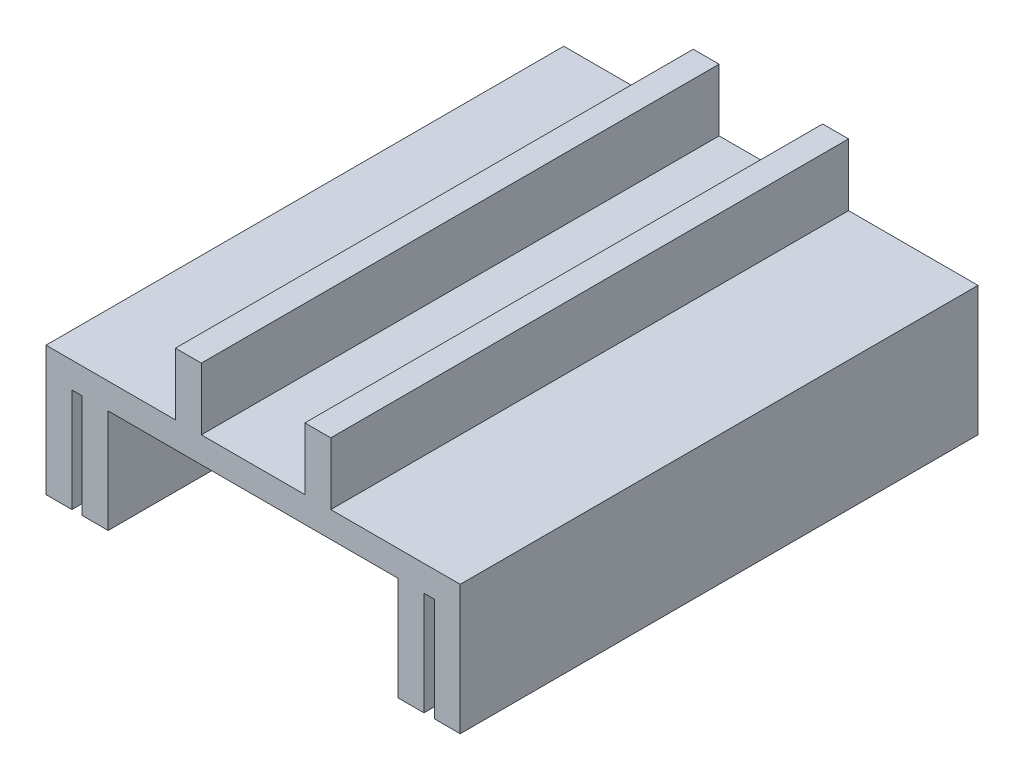
ISO-10303-21;
HEADER;
FILE_DESCRIPTION(('STEP AP214'),'2;1');
FILE_NAME('part.step','',(''),(''),'','','');
FILE_SCHEMA(('AUTOMOTIVE_DESIGN { 1 0 10303 214 1 1 1 1 }'));
ENDSEC;
DATA;
#1=APPLICATION_CONTEXT('core data for automotive mechanical design processes');
#2=APPLICATION_PROTOCOL_DEFINITION('international standard','automotive_design',2000,#1);
#3=PRODUCT_CONTEXT('',#1,'mechanical');
#4=PRODUCT('Part','Part','',(#3));
#5=PRODUCT_RELATED_PRODUCT_CATEGORY('part','',(#4));
#6=PRODUCT_DEFINITION_FORMATION('','',#4);
#7=PRODUCT_DEFINITION_CONTEXT('part definition',#1,'design');
#8=PRODUCT_DEFINITION('design','',#6,#7);
#9=PRODUCT_DEFINITION_SHAPE('','',#8);
#10=(LENGTH_UNIT() NAMED_UNIT(*) SI_UNIT(.MILLI.,.METRE.));
#11=(NAMED_UNIT(*) PLANE_ANGLE_UNIT() SI_UNIT($,.RADIAN.));
#12=(NAMED_UNIT(*) SI_UNIT($,.STERADIAN.) SOLID_ANGLE_UNIT());
#13=UNCERTAINTY_MEASURE_WITH_UNIT(LENGTH_MEASURE(1.E-05),#10,'distance_accuracy_value','');
#14=(GEOMETRIC_REPRESENTATION_CONTEXT(3) GLOBAL_UNCERTAINTY_ASSIGNED_CONTEXT((#13)) GLOBAL_UNIT_ASSIGNED_CONTEXT((#10,
#11,#12)) REPRESENTATION_CONTEXT('',''));
#15=CARTESIAN_POINT('',(0.,0.,0.));
#16=DIRECTION('',(0.,0.,1.));
#17=DIRECTION('',(1.,0.,0.));
#18=AXIS2_PLACEMENT_3D('',#15,#16,#17);
#19=CARTESIAN_POINT('',(0.,5.,0.));
#20=DIRECTION('',(0.,-1.,0.));
#21=DIRECTION('',(0.,0.,-1.));
#22=AXIS2_PLACEMENT_3D('',#19,#20,#21);
#23=PLANE('',#22);
#24=DIRECTION('',(0.,0.,1.));
#25=VECTOR('',#24,1.);
#26=CARTESIAN_POINT('',(9.99999999999999,5.,-50.));
#27=LINE('',#26,#25);
#28=CARTESIAN_POINT('',(9.99999999999999,5.,-50.));
#29=VERTEX_POINT('',#28);
#30=CARTESIAN_POINT('',(9.99999999999999,5.,50.));
#31=VERTEX_POINT('',#30);
#32=EDGE_CURVE('E48',#29,#31,#27,.T.);
#33=ORIENTED_EDGE('',*,*,#32,.F.);
#34=DIRECTION('',(-1.,0.,0.));
#35=VECTOR('',#34,1.);
#36=CARTESIAN_POINT('',(-40.,5.,-50.));
#37=LINE('',#36,#35);
#38=CARTESIAN_POINT('',(-10.,5.,-50.));
#39=VERTEX_POINT('',#38);
#40=EDGE_CURVE('E217',#29,#39,#37,.T.);
#41=ORIENTED_EDGE('',*,*,#40,.T.);
#42=DIRECTION('',(0.,0.,-1.));
#43=VECTOR('',#42,1.);
#44=CARTESIAN_POINT('',(-10.,5.,-50.));
#45=LINE('',#44,#43);
#46=CARTESIAN_POINT('',(-10.,5.,50.));
#47=VERTEX_POINT('',#46);
#48=EDGE_CURVE('E221',#47,#39,#45,.T.);
#49=ORIENTED_EDGE('',*,*,#48,.F.);
#50=DIRECTION('',(1.,0.,0.));
#51=VECTOR('',#50,1.);
#52=CARTESIAN_POINT('',(-40.,5.,50.));
#53=LINE('',#52,#51);
#54=EDGE_CURVE('E345',#47,#31,#53,.T.);
#55=ORIENTED_EDGE('',*,*,#54,.T.);
#56=EDGE_LOOP('',(#33,#41,#49,#55));
#57=FACE_BOUND('',#56,.T.);
#58=ADVANCED_FACE('F33',(#57),#23,.F.);
#59=DIRECTION('',(0.,0.,-1.));
#60=VECTOR('',#59,1.);
#61=CARTESIAN_POINT('',(15.,5.,50.));
#62=LINE('',#61,#60);
#63=CARTESIAN_POINT('',(15.,5.,50.));
#64=VERTEX_POINT('',#63);
#65=CARTESIAN_POINT('',(15.,5.,-50.));
#66=VERTEX_POINT('',#65);
#67=EDGE_CURVE('E213',#64,#66,#62,.T.);
#68=ORIENTED_EDGE('',*,*,#67,.F.);
#69=CARTESIAN_POINT('',(40.,5.,50.));
#70=VERTEX_POINT('',#69);
#71=EDGE_CURVE('E341',#64,#70,#53,.T.);
#72=ORIENTED_EDGE('',*,*,#71,.T.);
#73=DIRECTION('',(0.,0.,-1.));
#74=VECTOR('',#73,1.);
#75=CARTESIAN_POINT('',(40.,5.,50.));
#76=LINE('',#75,#74);
#77=CARTESIAN_POINT('',(40.,5.,-50.));
#78=VERTEX_POINT('',#77);
#79=EDGE_CURVE('E334',#70,#78,#76,.T.);
#80=ORIENTED_EDGE('',*,*,#79,.T.);
#81=EDGE_CURVE('E56',#78,#66,#37,.T.);
#82=ORIENTED_EDGE('',*,*,#81,.T.);
#83=EDGE_LOOP('',(#68,#72,#80,#82));
#84=FACE_BOUND('',#83,.T.);
#85=ADVANCED_FACE('F391',(#84),#23,.F.);
#86=DIRECTION('',(0.,0.,1.));
#87=VECTOR('',#86,1.);
#88=CARTESIAN_POINT('',(-15.,5.,50.));
#89=LINE('',#88,#87);
#90=CARTESIAN_POINT('',(-15.,5.,-50.));
#91=VERTEX_POINT('',#90);
#92=CARTESIAN_POINT('',(-15.,5.,50.));
#93=VERTEX_POINT('',#92);
#94=EDGE_CURVE('E218',#91,#93,#89,.T.);
#95=ORIENTED_EDGE('',*,*,#94,.F.);
#96=CARTESIAN_POINT('',(-40.,5.,-50.));
#97=VERTEX_POINT('',#96);
#98=EDGE_CURVE('E336',#91,#97,#37,.T.);
#99=ORIENTED_EDGE('',*,*,#98,.T.);
#100=DIRECTION('',(0.,0.,1.));
#101=VECTOR('',#100,1.);
#102=CARTESIAN_POINT('',(-40.,5.,50.));
#103=LINE('',#102,#101);
#104=CARTESIAN_POINT('',(-40.,5.,50.));
#105=VERTEX_POINT('',#104);
#106=EDGE_CURVE('E339',#97,#105,#103,.T.);
#107=ORIENTED_EDGE('',*,*,#106,.T.);
#108=EDGE_CURVE('E342',#105,#93,#53,.T.);
#109=ORIENTED_EDGE('',*,*,#108,.T.);
#110=EDGE_LOOP('',(#95,#99,#107,#109));
#111=FACE_BOUND('',#110,.T.);
#112=ADVANCED_FACE('F379',(#111),#23,.F.);
#113=CARTESIAN_POINT('',(0.,0.,0.));
#114=DIRECTION('',(0.,-1.,0.));
#115=DIRECTION('',(0.,0.,-1.));
#116=AXIS2_PLACEMENT_3D('',#113,#114,#115);
#117=PLANE('',#116);
#118=DIRECTION('',(-1.,0.,0.));
#119=VECTOR('',#118,1.);
#120=CARTESIAN_POINT('',(-40.,0.,-50.));
#121=LINE('',#120,#119);
#122=CARTESIAN_POINT('',(35.,0.,-50.));
#123=VERTEX_POINT('',#122);
#124=CARTESIAN_POINT('',(33.,0.,-50.));
#125=VERTEX_POINT('',#124);
#126=EDGE_CURVE('E346',#123,#125,#121,.T.);
#127=ORIENTED_EDGE('',*,*,#126,.F.);
#128=DIRECTION('',(0.,0.,-1.));
#129=VECTOR('',#128,1.);
#130=CARTESIAN_POINT('',(35.,0.,-50.));
#131=LINE('',#130,#129);
#132=CARTESIAN_POINT('',(35.,0.,50.));
#133=VERTEX_POINT('',#132);
#134=EDGE_CURVE('E249',#133,#123,#131,.T.);
#135=ORIENTED_EDGE('',*,*,#134,.F.);
#136=DIRECTION('',(1.,0.,0.));
#137=VECTOR('',#136,1.);
#138=CARTESIAN_POINT('',(-40.,0.,50.));
#139=LINE('',#138,#137);
#140=CARTESIAN_POINT('',(33.,0.,50.));
#141=VERTEX_POINT('',#140);
#142=EDGE_CURVE('E348',#141,#133,#139,.T.);
#143=ORIENTED_EDGE('',*,*,#142,.F.);
#144=DIRECTION('',(0.,0.,1.));
#145=VECTOR('',#144,1.);
#146=CARTESIAN_POINT('',(33.,0.,50.));
#147=LINE('',#146,#145);
#148=EDGE_CURVE('E271',#125,#141,#147,.T.);
#149=ORIENTED_EDGE('',*,*,#148,.F.);
#150=EDGE_LOOP('',(#127,#135,#143,#149));
#151=FACE_BOUND('',#150,.T.);
#152=ADVANCED_FACE('F412',(#151),#117,.T.);
#153=CARTESIAN_POINT('',(28.,0.,-50.));
#154=VERTEX_POINT('',#153);
#155=CARTESIAN_POINT('',(-28.,0.,-50.));
#156=VERTEX_POINT('',#155);
#157=EDGE_CURVE('E349',#154,#156,#121,.T.);
#158=ORIENTED_EDGE('',*,*,#157,.F.);
#159=DIRECTION('',(0.,0.,-1.));
#160=VECTOR('',#159,1.);
#161=CARTESIAN_POINT('',(28.,0.,-50.));
#162=LINE('',#161,#160);
#163=CARTESIAN_POINT('',(28.,0.,50.));
#164=VERTEX_POINT('',#163);
#165=EDGE_CURVE('E266',#164,#154,#162,.T.);
#166=ORIENTED_EDGE('',*,*,#165,.F.);
#167=CARTESIAN_POINT('',(-28.,0.,50.));
#168=VERTEX_POINT('',#167);
#169=EDGE_CURVE('E352',#168,#164,#139,.T.);
#170=ORIENTED_EDGE('',*,*,#169,.F.);
#171=DIRECTION('',(0.,0.,1.));
#172=VECTOR('',#171,1.);
#173=CARTESIAN_POINT('',(-28.,0.,-50.));
#174=LINE('',#173,#172);
#175=EDGE_CURVE('E295',#156,#168,#174,.T.);
#176=ORIENTED_EDGE('',*,*,#175,.F.);
#177=EDGE_LOOP('',(#158,#166,#170,#176));
#178=FACE_BOUND('',#177,.T.);
#179=ADVANCED_FACE('F433',(#178),#117,.T.);
#180=CARTESIAN_POINT('',(-33.,0.,-50.));
#181=VERTEX_POINT('',#180);
#182=CARTESIAN_POINT('',(-35.,0.,-50.));
#183=VERTEX_POINT('',#182);
#184=EDGE_CURVE('E333',#181,#183,#121,.T.);
#185=ORIENTED_EDGE('',*,*,#184,.F.);
#186=DIRECTION('',(0.,0.,-1.));
#187=VECTOR('',#186,1.);
#188=CARTESIAN_POINT('',(-33.,0.,50.));
#189=LINE('',#188,#187);
#190=CARTESIAN_POINT('',(-33.,0.,50.));
#191=VERTEX_POINT('',#190);
#192=EDGE_CURVE('E290',#191,#181,#189,.T.);
#193=ORIENTED_EDGE('',*,*,#192,.F.);
#194=CARTESIAN_POINT('',(-35.,0.,50.));
#195=VERTEX_POINT('',#194);
#196=EDGE_CURVE('E337',#195,#191,#139,.T.);
#197=ORIENTED_EDGE('',*,*,#196,.F.);
#198=DIRECTION('',(0.,0.,1.));
#199=VECTOR('',#198,1.);
#200=CARTESIAN_POINT('',(-35.,0.,-50.));
#201=LINE('',#200,#199);
#202=EDGE_CURVE('E314',#183,#195,#201,.T.);
#203=ORIENTED_EDGE('',*,*,#202,.F.);
#204=EDGE_LOOP('',(#185,#193,#197,#203));
#205=FACE_BOUND('',#204,.T.);
#206=ADVANCED_FACE('F448',(#205),#117,.T.);
#207=CARTESIAN_POINT('',(40.,5.,50.));
#208=DIRECTION('',(-1.,0.,0.));
#209=DIRECTION('',(0.,0.,1.));
#210=AXIS2_PLACEMENT_3D('',#207,#208,#209);
#211=PLANE('',#210);
#212=DIRECTION('',(0.,-1.,0.));
#213=VECTOR('',#212,1.);
#214=CARTESIAN_POINT('',(40.,5.,50.));
#215=LINE('',#214,#213);
#216=CARTESIAN_POINT('',(40.,-20.,50.));
#217=VERTEX_POINT('',#216);
#218=EDGE_CURVE('E344',#70,#217,#215,.T.);
#219=ORIENTED_EDGE('',*,*,#218,.T.);
#220=DIRECTION('',(0.,0.,1.));
#221=VECTOR('',#220,1.);
#222=CARTESIAN_POINT('',(40.,-20.,50.));
#223=LINE('',#222,#221);
#224=CARTESIAN_POINT('',(40.,-20.,-50.));
#225=VERTEX_POINT('',#224);
#226=EDGE_CURVE('E250',#225,#217,#223,.T.);
#227=ORIENTED_EDGE('',*,*,#226,.F.);
#228=DIRECTION('',(0.,-1.,0.));
#229=VECTOR('',#228,1.);
#230=CARTESIAN_POINT('',(40.,5.,-50.));
#231=LINE('',#230,#229);
#232=EDGE_CURVE('E11',#78,#225,#231,.T.);
#233=ORIENTED_EDGE('',*,*,#232,.F.);
#234=ORIENTED_EDGE('',*,*,#79,.F.);
#235=EDGE_LOOP('',(#219,#227,#233,#234));
#236=FACE_BOUND('',#235,.T.);
#237=ADVANCED_FACE('F35',(#236),#211,.F.);
#238=CARTESIAN_POINT('',(-40.,5.,-50.));
#239=DIRECTION('',(0.,0.,1.));
#240=DIRECTION('',(1.,0.,0.));
#241=AXIS2_PLACEMENT_3D('',#238,#239,#240);
#242=PLANE('',#241);
#243=ORIENTED_EDGE('',*,*,#232,.T.);
#244=DIRECTION('',(1.,0.,0.));
#245=VECTOR('',#244,1.);
#246=CARTESIAN_POINT('',(40.,-20.,-50.));
#247=LINE('',#246,#245);
#248=CARTESIAN_POINT('',(35.,-20.,-50.));
#249=VERTEX_POINT('',#248);
#250=EDGE_CURVE('E257',#249,#225,#247,.T.);
#251=ORIENTED_EDGE('',*,*,#250,.F.);
#252=DIRECTION('',(0.,1.,0.));
#253=VECTOR('',#252,1.);
#254=CARTESIAN_POINT('',(35.,-20.,-50.));
#255=LINE('',#254,#253);
#256=EDGE_CURVE('E260',#249,#123,#255,.T.);
#257=ORIENTED_EDGE('',*,*,#256,.T.);
#258=ORIENTED_EDGE('',*,*,#126,.T.);
#259=DIRECTION('',(0.,1.,0.));
#260=VECTOR('',#259,1.);
#261=CARTESIAN_POINT('',(33.,-20.,-50.));
#262=LINE('',#261,#260);
#263=CARTESIAN_POINT('',(33.,-20.,-50.));
#264=VERTEX_POINT('',#263);
#265=EDGE_CURVE('E285',#264,#125,#262,.T.);
#266=ORIENTED_EDGE('',*,*,#265,.F.);
#267=DIRECTION('',(1.,0.,0.));
#268=VECTOR('',#267,1.);
#269=CARTESIAN_POINT('',(33.,-20.,-50.));
#270=LINE('',#269,#268);
#271=CARTESIAN_POINT('',(28.,-20.,-50.));
#272=VERTEX_POINT('',#271);
#273=EDGE_CURVE('E270',#272,#264,#270,.T.);
#274=ORIENTED_EDGE('',*,*,#273,.F.);
#275=DIRECTION('',(0.,1.,0.));
#276=VECTOR('',#275,1.);
#277=CARTESIAN_POINT('',(28.,-20.,-50.));
#278=LINE('',#277,#276);
#279=EDGE_CURVE('E288',#272,#154,#278,.T.);
#280=ORIENTED_EDGE('',*,*,#279,.T.);
#281=ORIENTED_EDGE('',*,*,#157,.T.);
#282=DIRECTION('',(0.,1.,0.));
#283=VECTOR('',#282,1.);
#284=CARTESIAN_POINT('',(-28.,-20.,-50.));
#285=LINE('',#284,#283);
#286=CARTESIAN_POINT('',(-28.,-20.,-50.));
#287=VERTEX_POINT('',#286);
#288=EDGE_CURVE('E306',#287,#156,#285,.T.);
#289=ORIENTED_EDGE('',*,*,#288,.F.);
#290=DIRECTION('',(1.,0.,0.));
#291=VECTOR('',#290,1.);
#292=CARTESIAN_POINT('',(-33.,-20.,-50.));
#293=LINE('',#292,#291);
#294=CARTESIAN_POINT('',(-33.,-20.,-50.));
#295=VERTEX_POINT('',#294);
#296=EDGE_CURVE('E297',#295,#287,#293,.T.);
#297=ORIENTED_EDGE('',*,*,#296,.F.);
#298=DIRECTION('',(0.,1.,0.));
#299=VECTOR('',#298,1.);
#300=CARTESIAN_POINT('',(-33.,-20.,-50.));
#301=LINE('',#300,#299);
#302=EDGE_CURVE('E309',#295,#181,#301,.T.);
#303=ORIENTED_EDGE('',*,*,#302,.T.);
#304=ORIENTED_EDGE('',*,*,#184,.T.);
#305=DIRECTION('',(0.,1.,0.));
#306=VECTOR('',#305,1.);
#307=CARTESIAN_POINT('',(-35.,-20.,-50.));
#308=LINE('',#307,#306);
#309=CARTESIAN_POINT('',(-35.,-20.,-50.));
#310=VERTEX_POINT('',#309);
#311=EDGE_CURVE('E330',#310,#183,#308,.T.);
#312=ORIENTED_EDGE('',*,*,#311,.F.);
#313=DIRECTION('',(1.,0.,0.));
#314=VECTOR('',#313,1.);
#315=CARTESIAN_POINT('',(-40.,-20.,-50.));
#316=LINE('',#315,#314);
#317=CARTESIAN_POINT('',(-40.,-20.,-50.));
#318=VERTEX_POINT('',#317);
#319=EDGE_CURVE('E321',#318,#310,#316,.T.);
#320=ORIENTED_EDGE('',*,*,#319,.F.);
#321=DIRECTION('',(0.,-1.,0.));
#322=VECTOR('',#321,1.);
#323=CARTESIAN_POINT('',(-40.,5.,-50.));
#324=LINE('',#323,#322);
#325=EDGE_CURVE('E41',#97,#318,#324,.T.);
#326=ORIENTED_EDGE('',*,*,#325,.F.);
#327=ORIENTED_EDGE('',*,*,#98,.F.);
#328=DIRECTION('',(0.,-1.,0.));
#329=VECTOR('',#328,1.);
#330=CARTESIAN_POINT('',(-15.,17.,-50.));
#331=LINE('',#330,#329);
#332=CARTESIAN_POINT('',(-15.,17.,-50.));
#333=VERTEX_POINT('',#332);
#334=EDGE_CURVE('E246',#333,#91,#331,.T.);
#335=ORIENTED_EDGE('',*,*,#334,.F.);
#336=DIRECTION('',(-1.,0.,0.));
#337=VECTOR('',#336,1.);
#338=CARTESIAN_POINT('',(-15.,17.,-50.));
#339=LINE('',#338,#337);
#340=CARTESIAN_POINT('',(-10.,17.,-50.));
#341=VERTEX_POINT('',#340);
#342=EDGE_CURVE('E227',#341,#333,#339,.T.);
#343=ORIENTED_EDGE('',*,*,#342,.F.);
#344=DIRECTION('',(0.,-1.,0.));
#345=VECTOR('',#344,1.);
#346=CARTESIAN_POINT('',(-10.,17.,-50.));
#347=LINE('',#346,#345);
#348=EDGE_CURVE('E235',#341,#39,#347,.T.);
#349=ORIENTED_EDGE('',*,*,#348,.T.);
#350=ORIENTED_EDGE('',*,*,#40,.F.);
#351=DIRECTION('',(0.,-1.,0.));
#352=VECTOR('',#351,1.);
#353=CARTESIAN_POINT('',(9.99999999999999,17.,-50.));
#354=LINE('',#353,#352);
#355=CARTESIAN_POINT('',(9.99999999999999,17.,-50.));
#356=VERTEX_POINT('',#355);
#357=EDGE_CURVE('E198',#356,#29,#354,.T.);
#358=ORIENTED_EDGE('',*,*,#357,.F.);
#359=DIRECTION('',(-1.,0.,0.));
#360=VECTOR('',#359,1.);
#361=CARTESIAN_POINT('',(15.,17.,-50.));
#362=LINE('',#361,#360);
#363=CARTESIAN_POINT('',(15.,17.,-50.));
#364=VERTEX_POINT('',#363);
#365=EDGE_CURVE('E204',#364,#356,#362,.T.);
#366=ORIENTED_EDGE('',*,*,#365,.F.);
#367=DIRECTION('',(0.,-1.,0.));
#368=VECTOR('',#367,1.);
#369=CARTESIAN_POINT('',(15.,17.,-50.));
#370=LINE('',#369,#368);
#371=EDGE_CURVE('E633',#364,#66,#370,.T.);
#372=ORIENTED_EDGE('',*,*,#371,.T.);
#373=ORIENTED_EDGE('',*,*,#81,.F.);
#374=EDGE_LOOP('',(#243,#251,#257,#258,#266,#274,#280,#281,#289,#297,#303,#304,#312,#320,#326,
#327,#335,#343,#349,#350,#358,#366,#372,#373));
#375=FACE_BOUND('',#374,.T.);
#376=ADVANCED_FACE('F215',(#375),#242,.F.);
#377=CARTESIAN_POINT('',(-40.,5.,50.));
#378=DIRECTION('',(1.,0.,0.));
#379=DIRECTION('',(0.,0.,-1.));
#380=AXIS2_PLACEMENT_3D('',#377,#378,#379);
#381=PLANE('',#380);
#382=ORIENTED_EDGE('',*,*,#325,.T.);
#383=DIRECTION('',(0.,0.,-1.));
#384=VECTOR('',#383,1.);
#385=CARTESIAN_POINT('',(-40.,-20.,50.));
#386=LINE('',#385,#384);
#387=CARTESIAN_POINT('',(-40.,-20.,50.));
#388=VERTEX_POINT('',#387);
#389=EDGE_CURVE('E318',#388,#318,#386,.T.);
#390=ORIENTED_EDGE('',*,*,#389,.F.);
#391=DIRECTION('',(0.,-1.,0.));
#392=VECTOR('',#391,1.);
#393=CARTESIAN_POINT('',(-40.,5.,50.));
#394=LINE('',#393,#392);
#395=EDGE_CURVE('E354',#105,#388,#394,.T.);
#396=ORIENTED_EDGE('',*,*,#395,.F.);
#397=ORIENTED_EDGE('',*,*,#106,.F.);
#398=EDGE_LOOP('',(#382,#390,#396,#397));
#399=FACE_BOUND('',#398,.T.);
#400=ADVANCED_FACE('F359',(#399),#381,.F.);
#401=CARTESIAN_POINT('',(-40.,5.,50.));
#402=DIRECTION('',(0.,0.,-1.));
#403=DIRECTION('',(-1.,0.,0.));
#404=AXIS2_PLACEMENT_3D('',#401,#402,#403);
#405=PLANE('',#404);
#406=ORIENTED_EDGE('',*,*,#395,.T.);
#407=DIRECTION('',(-1.,0.,0.));
#408=VECTOR('',#407,1.);
#409=CARTESIAN_POINT('',(-35.,-20.,50.));
#410=LINE('',#409,#408);
#411=CARTESIAN_POINT('',(-35.,-20.,50.));
#412=VERTEX_POINT('',#411);
#413=EDGE_CURVE('E315',#412,#388,#410,.T.);
#414=ORIENTED_EDGE('',*,*,#413,.F.);
#415=DIRECTION('',(0.,1.,0.));
#416=VECTOR('',#415,1.);
#417=CARTESIAN_POINT('',(-35.,-20.,50.));
#418=LINE('',#417,#416);
#419=EDGE_CURVE('E325',#412,#195,#418,.T.);
#420=ORIENTED_EDGE('',*,*,#419,.T.);
#421=ORIENTED_EDGE('',*,*,#196,.T.);
#422=DIRECTION('',(0.,1.,0.));
#423=VECTOR('',#422,1.);
#424=CARTESIAN_POINT('',(-33.,-20.,50.));
#425=LINE('',#424,#423);
#426=CARTESIAN_POINT('',(-33.,-20.,50.));
#427=VERTEX_POINT('',#426);
#428=EDGE_CURVE('E312',#427,#191,#425,.T.);
#429=ORIENTED_EDGE('',*,*,#428,.F.);
#430=DIRECTION('',(-1.,0.,0.));
#431=VECTOR('',#430,1.);
#432=CARTESIAN_POINT('',(-28.,-20.,50.));
#433=LINE('',#432,#431);
#434=CARTESIAN_POINT('',(-28.,-20.,50.));
#435=VERTEX_POINT('',#434);
#436=EDGE_CURVE('E291',#435,#427,#433,.T.);
#437=ORIENTED_EDGE('',*,*,#436,.F.);
#438=DIRECTION('',(0.,1.,0.));
#439=VECTOR('',#438,1.);
#440=CARTESIAN_POINT('',(-28.,-20.,50.));
#441=LINE('',#440,#439);
#442=EDGE_CURVE('E301',#435,#168,#441,.T.);
#443=ORIENTED_EDGE('',*,*,#442,.T.);
#444=ORIENTED_EDGE('',*,*,#169,.T.);
#445=DIRECTION('',(0.,1.,0.));
#446=VECTOR('',#445,1.);
#447=CARTESIAN_POINT('',(28.,-20.,50.));
#448=LINE('',#447,#446);
#449=CARTESIAN_POINT('',(28.,-20.,50.));
#450=VERTEX_POINT('',#449);
#451=EDGE_CURVE('E277',#450,#164,#448,.T.);
#452=ORIENTED_EDGE('',*,*,#451,.F.);
#453=DIRECTION('',(-1.,0.,0.));
#454=VECTOR('',#453,1.);
#455=CARTESIAN_POINT('',(28.,-20.,50.));
#456=LINE('',#455,#454);
#457=CARTESIAN_POINT('',(33.,-20.,50.));
#458=VERTEX_POINT('',#457);
#459=EDGE_CURVE('E275',#458,#450,#456,.T.);
#460=ORIENTED_EDGE('',*,*,#459,.F.);
#461=DIRECTION('',(0.,1.,0.));
#462=VECTOR('',#461,1.);
#463=CARTESIAN_POINT('',(33.,-20.,50.));
#464=LINE('',#463,#462);
#465=EDGE_CURVE('E283',#458,#141,#464,.T.);
#466=ORIENTED_EDGE('',*,*,#465,.T.);
#467=ORIENTED_EDGE('',*,*,#142,.T.);
#468=DIRECTION('',(0.,1.,0.));
#469=VECTOR('',#468,1.);
#470=CARTESIAN_POINT('',(35.,-20.,50.));
#471=LINE('',#470,#469);
#472=CARTESIAN_POINT('',(35.,-20.,50.));
#473=VERTEX_POINT('',#472);
#474=EDGE_CURVE('E264',#473,#133,#471,.T.);
#475=ORIENTED_EDGE('',*,*,#474,.F.);
#476=DIRECTION('',(-1.,0.,0.));
#477=VECTOR('',#476,1.);
#478=CARTESIAN_POINT('',(35.,-20.,50.));
#479=LINE('',#478,#477);
#480=EDGE_CURVE('E253',#217,#473,#479,.T.);
#481=ORIENTED_EDGE('',*,*,#480,.F.);
#482=ORIENTED_EDGE('',*,*,#218,.F.);
#483=ORIENTED_EDGE('',*,*,#71,.F.);
#484=DIRECTION('',(0.,-1.,0.));
#485=VECTOR('',#484,1.);
#486=CARTESIAN_POINT('',(15.,17.,50.));
#487=LINE('',#486,#485);
#488=CARTESIAN_POINT('',(15.,17.,50.));
#489=VERTEX_POINT('',#488);
#490=EDGE_CURVE('E223',#489,#64,#487,.T.);
#491=ORIENTED_EDGE('',*,*,#490,.F.);
#492=DIRECTION('',(1.,0.,0.));
#493=VECTOR('',#492,1.);
#494=CARTESIAN_POINT('',(10.,17.,50.));
#495=LINE('',#494,#493);
#496=CARTESIAN_POINT('',(10.,17.,50.));
#497=VERTEX_POINT('',#496);
#498=EDGE_CURVE('E203',#497,#489,#495,.T.);
#499=ORIENTED_EDGE('',*,*,#498,.F.);
#500=DIRECTION('',(0.,-1.,0.));
#501=VECTOR('',#500,1.);
#502=CARTESIAN_POINT('',(10.,17.,50.));
#503=LINE('',#502,#501);
#504=EDGE_CURVE('E200',#497,#31,#503,.T.);
#505=ORIENTED_EDGE('',*,*,#504,.T.);
#506=ORIENTED_EDGE('',*,*,#54,.F.);
#507=DIRECTION('',(0.,-1.,0.));
#508=VECTOR('',#507,1.);
#509=CARTESIAN_POINT('',(-9.99999999999999,17.,50.));
#510=LINE('',#509,#508);
#511=CARTESIAN_POINT('',(-9.99999999999999,17.,50.));
#512=VERTEX_POINT('',#511);
#513=EDGE_CURVE('E240',#512,#47,#510,.T.);
#514=ORIENTED_EDGE('',*,*,#513,.F.);
#515=DIRECTION('',(1.,0.,0.));
#516=VECTOR('',#515,1.);
#517=CARTESIAN_POINT('',(-9.99999999999999,17.,50.));
#518=LINE('',#517,#516);
#519=CARTESIAN_POINT('',(-15.,17.,50.));
#520=VERTEX_POINT('',#519);
#521=EDGE_CURVE('E232',#520,#512,#518,.T.);
#522=ORIENTED_EDGE('',*,*,#521,.F.);
#523=DIRECTION('',(0.,-1.,0.));
#524=VECTOR('',#523,1.);
#525=CARTESIAN_POINT('',(-15.,17.,50.));
#526=LINE('',#525,#524);
#527=EDGE_CURVE('E243',#520,#93,#526,.T.);
#528=ORIENTED_EDGE('',*,*,#527,.T.);
#529=ORIENTED_EDGE('',*,*,#108,.F.);
#530=EDGE_LOOP('',(#406,#414,#420,#421,#429,#437,#443,#444,#452,#460,#466,#467,#475,#481,#482,
#483,#491,#499,#505,#506,#514,#522,#528,#529));
#531=FACE_BOUND('',#530,.T.);
#532=ADVANCED_FACE('F374',(#531),#405,.F.);
#533=CARTESIAN_POINT('',(-35.,-20.,-50.));
#534=DIRECTION('',(-1.,0.,0.));
#535=DIRECTION('',(0.,0.,1.));
#536=AXIS2_PLACEMENT_3D('',#533,#534,#535);
#537=PLANE('',#536);
#538=ORIENTED_EDGE('',*,*,#202,.T.);
#539=ORIENTED_EDGE('',*,*,#419,.F.);
#540=DIRECTION('',(0.,0.,1.));
#541=VECTOR('',#540,1.);
#542=CARTESIAN_POINT('',(-35.,-20.,-50.));
#543=LINE('',#542,#541);
#544=EDGE_CURVE('E323',#310,#412,#543,.T.);
#545=ORIENTED_EDGE('',*,*,#544,.F.);
#546=ORIENTED_EDGE('',*,*,#311,.T.);
#547=EDGE_LOOP('',(#538,#539,#545,#546));
#548=FACE_BOUND('',#547,.T.);
#549=ADVANCED_FACE('F372',(#548),#537,.F.);
#550=CARTESIAN_POINT('',(0.,-20.,0.));
#551=DIRECTION('',(0.,-1.,0.));
#552=DIRECTION('',(0.,0.,-1.));
#553=AXIS2_PLACEMENT_3D('',#550,#551,#552);
#554=PLANE('',#553);
#555=ORIENTED_EDGE('',*,*,#413,.T.);
#556=ORIENTED_EDGE('',*,*,#389,.T.);
#557=ORIENTED_EDGE('',*,*,#319,.T.);
#558=ORIENTED_EDGE('',*,*,#544,.T.);
#559=EDGE_LOOP('',(#555,#556,#557,#558));
#560=FACE_BOUND('',#559,.T.);
#561=ADVANCED_FACE('F364',(#560),#554,.T.);
#562=CARTESIAN_POINT('',(-33.,-20.,50.));
#563=DIRECTION('',(1.,0.,0.));
#564=DIRECTION('',(0.,0.,-1.));
#565=AXIS2_PLACEMENT_3D('',#562,#563,#564);
#566=PLANE('',#565);
#567=ORIENTED_EDGE('',*,*,#192,.T.);
#568=ORIENTED_EDGE('',*,*,#302,.F.);
#569=DIRECTION('',(0.,0.,-1.));
#570=VECTOR('',#569,1.);
#571=CARTESIAN_POINT('',(-33.,-20.,50.));
#572=LINE('',#571,#570);
#573=EDGE_CURVE('E294',#427,#295,#572,.T.);
#574=ORIENTED_EDGE('',*,*,#573,.F.);
#575=ORIENTED_EDGE('',*,*,#428,.T.);
#576=EDGE_LOOP('',(#567,#568,#574,#575));
#577=FACE_BOUND('',#576,.T.);
#578=ADVANCED_FACE('F449',(#577),#566,.F.);
#579=CARTESIAN_POINT('',(-28.,-20.,-50.));
#580=DIRECTION('',(-1.,0.,0.));
#581=DIRECTION('',(0.,0.,1.));
#582=AXIS2_PLACEMENT_3D('',#579,#580,#581);
#583=PLANE('',#582);
#584=ORIENTED_EDGE('',*,*,#175,.T.);
#585=ORIENTED_EDGE('',*,*,#442,.F.);
#586=DIRECTION('',(0.,0.,1.));
#587=VECTOR('',#586,1.);
#588=CARTESIAN_POINT('',(-28.,-20.,-50.));
#589=LINE('',#588,#587);
#590=EDGE_CURVE('E299',#287,#435,#589,.T.);
#591=ORIENTED_EDGE('',*,*,#590,.F.);
#592=ORIENTED_EDGE('',*,*,#288,.T.);
#593=EDGE_LOOP('',(#584,#585,#591,#592));
#594=FACE_BOUND('',#593,.T.);
#595=ADVANCED_FACE('F438',(#594),#583,.F.);
#596=CARTESIAN_POINT('',(0.,-20.,0.));
#597=DIRECTION('',(0.,-1.,0.));
#598=DIRECTION('',(0.,0.,-1.));
#599=AXIS2_PLACEMENT_3D('',#596,#597,#598);
#600=PLANE('',#599);
#601=ORIENTED_EDGE('',*,*,#436,.T.);
#602=ORIENTED_EDGE('',*,*,#573,.T.);
#603=ORIENTED_EDGE('',*,*,#296,.T.);
#604=ORIENTED_EDGE('',*,*,#590,.T.);
#605=EDGE_LOOP('',(#601,#602,#603,#604));
#606=FACE_BOUND('',#605,.T.);
#607=ADVANCED_FACE('F442',(#606),#600,.T.);
#608=CARTESIAN_POINT('',(28.,-20.,-50.));
#609=DIRECTION('',(1.,0.,0.));
#610=DIRECTION('',(0.,0.,-1.));
#611=AXIS2_PLACEMENT_3D('',#608,#609,#610);
#612=PLANE('',#611);
#613=ORIENTED_EDGE('',*,*,#165,.T.);
#614=ORIENTED_EDGE('',*,*,#279,.F.);
#615=DIRECTION('',(0.,0.,-1.));
#616=VECTOR('',#615,1.);
#617=CARTESIAN_POINT('',(28.,-20.,-50.));
#618=LINE('',#617,#616);
#619=EDGE_CURVE('E267',#450,#272,#618,.T.);
#620=ORIENTED_EDGE('',*,*,#619,.F.);
#621=ORIENTED_EDGE('',*,*,#451,.T.);
#622=EDGE_LOOP('',(#613,#614,#620,#621));
#623=FACE_BOUND('',#622,.T.);
#624=ADVANCED_FACE('F426',(#623),#612,.F.);
#625=CARTESIAN_POINT('',(33.,-20.,50.));
#626=DIRECTION('',(-1.,0.,0.));
#627=DIRECTION('',(0.,0.,1.));
#628=AXIS2_PLACEMENT_3D('',#625,#626,#627);
#629=PLANE('',#628);
#630=ORIENTED_EDGE('',*,*,#148,.T.);
#631=ORIENTED_EDGE('',*,*,#465,.F.);
#632=DIRECTION('',(0.,0.,1.));
#633=VECTOR('',#632,1.);
#634=CARTESIAN_POINT('',(33.,-20.,50.));
#635=LINE('',#634,#633);
#636=EDGE_CURVE('E273',#264,#458,#635,.T.);
#637=ORIENTED_EDGE('',*,*,#636,.F.);
#638=ORIENTED_EDGE('',*,*,#265,.T.);
#639=EDGE_LOOP('',(#630,#631,#637,#638));
#640=FACE_BOUND('',#639,.T.);
#641=ADVANCED_FACE('F417',(#640),#629,.F.);
#642=CARTESIAN_POINT('',(0.,-20.,0.));
#643=DIRECTION('',(0.,1.,0.));
#644=DIRECTION('',(0.,0.,1.));
#645=AXIS2_PLACEMENT_3D('',#642,#643,#644);
#646=PLANE('',#645);
#647=ORIENTED_EDGE('',*,*,#619,.T.);
#648=ORIENTED_EDGE('',*,*,#273,.T.);
#649=ORIENTED_EDGE('',*,*,#636,.T.);
#650=ORIENTED_EDGE('',*,*,#459,.T.);
#651=EDGE_LOOP('',(#647,#648,#649,#650));
#652=FACE_BOUND('',#651,.T.);
#653=ADVANCED_FACE('F423',(#652),#646,.F.);
#654=CARTESIAN_POINT('',(35.,-20.,-50.));
#655=DIRECTION('',(1.,0.,0.));
#656=DIRECTION('',(0.,0.,-1.));
#657=AXIS2_PLACEMENT_3D('',#654,#655,#656);
#658=PLANE('',#657);
#659=ORIENTED_EDGE('',*,*,#134,.T.);
#660=ORIENTED_EDGE('',*,*,#256,.F.);
#661=DIRECTION('',(0.,0.,-1.));
#662=VECTOR('',#661,1.);
#663=CARTESIAN_POINT('',(35.,-20.,-50.));
#664=LINE('',#663,#662);
#665=EDGE_CURVE('E255',#473,#249,#664,.T.);
#666=ORIENTED_EDGE('',*,*,#665,.F.);
#667=ORIENTED_EDGE('',*,*,#474,.T.);
#668=EDGE_LOOP('',(#659,#660,#666,#667));
#669=FACE_BOUND('',#668,.T.);
#670=ADVANCED_FACE('F406',(#669),#658,.F.);
#671=CARTESIAN_POINT('',(0.,-20.,0.));
#672=DIRECTION('',(0.,1.,0.));
#673=DIRECTION('',(0.,0.,1.));
#674=AXIS2_PLACEMENT_3D('',#671,#672,#673);
#675=PLANE('',#674);
#676=ORIENTED_EDGE('',*,*,#226,.T.);
#677=ORIENTED_EDGE('',*,*,#480,.T.);
#678=ORIENTED_EDGE('',*,*,#665,.T.);
#679=ORIENTED_EDGE('',*,*,#250,.T.);
#680=EDGE_LOOP('',(#676,#677,#678,#679));
#681=FACE_BOUND('',#680,.T.);
#682=ADVANCED_FACE('F402',(#681),#675,.F.);
#683=CARTESIAN_POINT('',(-15.,17.,50.));
#684=DIRECTION('',(1.,0.,0.));
#685=DIRECTION('',(0.,0.,-1.));
#686=AXIS2_PLACEMENT_3D('',#683,#684,#685);
#687=PLANE('',#686);
#688=ORIENTED_EDGE('',*,*,#94,.T.);
#689=ORIENTED_EDGE('',*,*,#527,.F.);
#690=DIRECTION('',(0.,0.,1.));
#691=VECTOR('',#690,1.);
#692=CARTESIAN_POINT('',(-15.,17.,50.));
#693=LINE('',#692,#691);
#694=EDGE_CURVE('E230',#333,#520,#693,.T.);
#695=ORIENTED_EDGE('',*,*,#694,.F.);
#696=ORIENTED_EDGE('',*,*,#334,.T.);
#697=EDGE_LOOP('',(#688,#689,#695,#696));
#698=FACE_BOUND('',#697,.T.);
#699=ADVANCED_FACE('F381',(#698),#687,.F.);
#700=CARTESIAN_POINT('',(-10.,17.,-50.));
#701=DIRECTION('',(-1.,0.,0.));
#702=DIRECTION('',(0.,0.,1.));
#703=AXIS2_PLACEMENT_3D('',#700,#701,#702);
#704=PLANE('',#703);
#705=ORIENTED_EDGE('',*,*,#48,.T.);
#706=ORIENTED_EDGE('',*,*,#348,.F.);
#707=DIRECTION('',(0.,0.,-1.));
#708=VECTOR('',#707,1.);
#709=CARTESIAN_POINT('',(-10.,17.,-50.));
#710=LINE('',#709,#708);
#711=EDGE_CURVE('E234',#512,#341,#710,.T.);
#712=ORIENTED_EDGE('',*,*,#711,.F.);
#713=ORIENTED_EDGE('',*,*,#513,.T.);
#714=EDGE_LOOP('',(#705,#706,#712,#713));
#715=FACE_BOUND('',#714,.T.);
#716=ADVANCED_FACE('F387',(#715),#704,.F.);
#717=CARTESIAN_POINT('',(0.,17.,0.));
#718=DIRECTION('',(0.,-1.,0.));
#719=DIRECTION('',(0.,0.,-1.));
#720=AXIS2_PLACEMENT_3D('',#717,#718,#719);
#721=PLANE('',#720);
#722=ORIENTED_EDGE('',*,*,#342,.T.);
#723=ORIENTED_EDGE('',*,*,#694,.T.);
#724=ORIENTED_EDGE('',*,*,#521,.T.);
#725=ORIENTED_EDGE('',*,*,#711,.T.);
#726=EDGE_LOOP('',(#722,#723,#724,#725));
#727=FACE_BOUND('',#726,.T.);
#728=ADVANCED_FACE('F594',(#727),#721,.F.);
#729=CARTESIAN_POINT('',(9.99999999999999,17.,-50.));
#730=DIRECTION('',(1.,0.,0.));
#731=DIRECTION('',(0.,0.,-1.));
#732=AXIS2_PLACEMENT_3D('',#729,#730,#731);
#733=PLANE('',#732);
#734=ORIENTED_EDGE('',*,*,#32,.T.);
#735=ORIENTED_EDGE('',*,*,#504,.F.);
#736=DIRECTION('',(0.,0.,1.));
#737=VECTOR('',#736,1.);
#738=CARTESIAN_POINT('',(9.99999999999999,17.,-50.));
#739=LINE('',#738,#737);
#740=EDGE_CURVE('E194',#356,#497,#739,.T.);
#741=ORIENTED_EDGE('',*,*,#740,.F.);
#742=ORIENTED_EDGE('',*,*,#357,.T.);
#743=EDGE_LOOP('',(#734,#735,#741,#742));
#744=FACE_BOUND('',#743,.T.);
#745=ADVANCED_FACE('F196',(#744),#733,.F.);
#746=CARTESIAN_POINT('',(15.,17.,50.));
#747=DIRECTION('',(-1.,0.,0.));
#748=DIRECTION('',(0.,0.,1.));
#749=AXIS2_PLACEMENT_3D('',#746,#747,#748);
#750=PLANE('',#749);
#751=ORIENTED_EDGE('',*,*,#67,.T.);
#752=ORIENTED_EDGE('',*,*,#371,.F.);
#753=DIRECTION('',(0.,0.,-1.));
#754=VECTOR('',#753,1.);
#755=CARTESIAN_POINT('',(15.,17.,50.));
#756=LINE('',#755,#754);
#757=EDGE_CURVE('E209',#489,#364,#756,.T.);
#758=ORIENTED_EDGE('',*,*,#757,.F.);
#759=ORIENTED_EDGE('',*,*,#490,.T.);
#760=EDGE_LOOP('',(#751,#752,#758,#759));
#761=FACE_BOUND('',#760,.T.);
#762=ADVANCED_FACE('F612',(#761),#750,.F.);
#763=CARTESIAN_POINT('',(0.,17.,0.));
#764=DIRECTION('',(0.,1.,0.));
#765=DIRECTION('',(0.,0.,1.));
#766=AXIS2_PLACEMENT_3D('',#763,#764,#765);
#767=PLANE('',#766);
#768=ORIENTED_EDGE('',*,*,#365,.T.);
#769=ORIENTED_EDGE('',*,*,#740,.T.);
#770=ORIENTED_EDGE('',*,*,#498,.T.);
#771=ORIENTED_EDGE('',*,*,#757,.T.);
#772=EDGE_LOOP('',(#768,#769,#770,#771));
#773=FACE_BOUND('',#772,.T.);
#774=ADVANCED_FACE('F207',(#773),#767,.T.);
#775=CLOSED_SHELL('',(#58,#85,#112,#152,#179,#206,#237,#376,#400,#532,#549,#561,#578,#595,#607,
#624,#641,#653,#670,#682,#699,#716,#728,#745,#762,#774));
#776=MANIFOLD_SOLID_BREP('B2',#775);
#777=ADVANCED_BREP_SHAPE_REPRESENTATION('',(#18,#776),#14);
#778=SHAPE_DEFINITION_REPRESENTATION(#9,#777);
ENDSEC;
END-ISO-10303-21;
